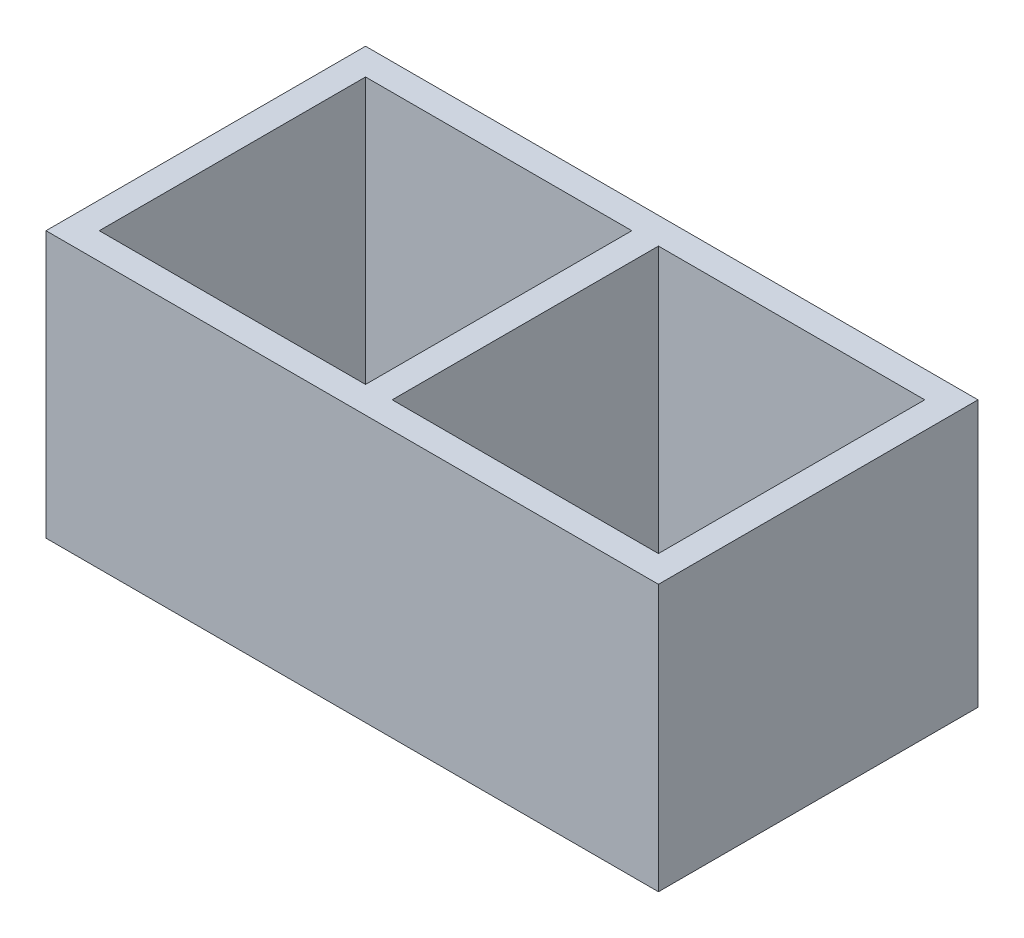
ISO-10303-21;
HEADER;
FILE_DESCRIPTION(('STEP AP214'),'2;1');
FILE_NAME('part.step','',(''),(''),'','','');
FILE_SCHEMA(('AUTOMOTIVE_DESIGN { 1 0 10303 214 1 1 1 1 }'));
ENDSEC;
DATA;
#1=APPLICATION_CONTEXT('core data for automotive mechanical design processes');
#2=APPLICATION_PROTOCOL_DEFINITION('international standard','automotive_design',2000,#1);
#3=PRODUCT_CONTEXT('',#1,'mechanical');
#4=PRODUCT('Part','Part','',(#3));
#5=PRODUCT_RELATED_PRODUCT_CATEGORY('part','',(#4));
#6=PRODUCT_DEFINITION_FORMATION('','',#4);
#7=PRODUCT_DEFINITION_CONTEXT('part definition',#1,'design');
#8=PRODUCT_DEFINITION('design','',#6,#7);
#9=PRODUCT_DEFINITION_SHAPE('','',#8);
#10=(LENGTH_UNIT() NAMED_UNIT(*) SI_UNIT(.MILLI.,.METRE.));
#11=(NAMED_UNIT(*) PLANE_ANGLE_UNIT() SI_UNIT($,.RADIAN.));
#12=(NAMED_UNIT(*) SI_UNIT($,.STERADIAN.) SOLID_ANGLE_UNIT());
#13=UNCERTAINTY_MEASURE_WITH_UNIT(LENGTH_MEASURE(1.E-05),#10,'distance_accuracy_value','');
#14=(GEOMETRIC_REPRESENTATION_CONTEXT(3) GLOBAL_UNCERTAINTY_ASSIGNED_CONTEXT((#13)) GLOBAL_UNIT_ASSIGNED_CONTEXT((#10,
#11,#12)) REPRESENTATION_CONTEXT('',''));
#15=CARTESIAN_POINT('',(0.,0.,0.));
#16=DIRECTION('',(0.,0.,1.));
#17=DIRECTION('',(1.,0.,0.));
#18=AXIS2_PLACEMENT_3D('',#15,#16,#17);
#19=CARTESIAN_POINT('',(0.,15.,0.));
#20=DIRECTION('',(0.,1.,0.));
#21=DIRECTION('',(0.,0.,1.));
#22=AXIS2_PLACEMENT_3D('',#19,#20,#21);
#23=PLANE('',#22);
#24=DIRECTION('',(-1.,0.,0.));
#25=VECTOR('',#24,1.);
#26=CARTESIAN_POINT('',(-15.75,15.,-7.5));
#27=LINE('',#26,#25);
#28=CARTESIAN_POINT('',(-0.749999999999969,15.,-7.5));
#29=VERTEX_POINT('',#28);
#30=CARTESIAN_POINT('',(-15.75,15.,-7.5));
#31=VERTEX_POINT('',#30);
#32=EDGE_CURVE('E160',#29,#31,#27,.T.);
#33=ORIENTED_EDGE('',*,*,#32,.F.);
#34=DIRECTION('',(0.,0.,-1.));
#35=VECTOR('',#34,1.);
#36=CARTESIAN_POINT('',(-0.749999999999969,15.,7.5));
#37=LINE('',#36,#35);
#38=CARTESIAN_POINT('',(-0.749999999999969,15.,7.5));
#39=VERTEX_POINT('',#38);
#40=EDGE_CURVE('E158',#39,#29,#37,.T.);
#41=ORIENTED_EDGE('',*,*,#40,.F.);
#42=DIRECTION('',(1.,0.,0.));
#43=VECTOR('',#42,1.);
#44=CARTESIAN_POINT('',(-15.75,15.,7.5));
#45=LINE('',#44,#43);
#46=CARTESIAN_POINT('',(-15.75,15.,7.5));
#47=VERTEX_POINT('',#46);
#48=EDGE_CURVE('E166',#47,#39,#45,.T.);
#49=ORIENTED_EDGE('',*,*,#48,.F.);
#50=DIRECTION('',(0.,0.,1.));
#51=VECTOR('',#50,1.);
#52=CARTESIAN_POINT('',(-15.75,15.,7.5));
#53=LINE('',#52,#51);
#54=EDGE_CURVE('E163',#31,#47,#53,.T.);
#55=ORIENTED_EDGE('',*,*,#54,.F.);
#56=EDGE_LOOP('',(#33,#41,#49,#55));
#57=FACE_BOUND('',#56,.T.);
#58=DIRECTION('',(0.,0.,1.));
#59=VECTOR('',#58,1.);
#60=CARTESIAN_POINT('',(-17.25,15.,9.));
#61=LINE('',#60,#59);
#62=CARTESIAN_POINT('',(-17.25,15.,-9.));
#63=VERTEX_POINT('',#62);
#64=CARTESIAN_POINT('',(-17.25,15.,9.));
#65=VERTEX_POINT('',#64);
#66=EDGE_CURVE('E189',#63,#65,#61,.T.);
#67=ORIENTED_EDGE('',*,*,#66,.T.);
#68=DIRECTION('',(1.,0.,0.));
#69=VECTOR('',#68,1.);
#70=CARTESIAN_POINT('',(17.25,15.,9.));
#71=LINE('',#70,#69);
#72=CARTESIAN_POINT('',(17.25,15.,9.));
#73=VERTEX_POINT('',#72);
#74=EDGE_CURVE('E192',#65,#73,#71,.T.);
#75=ORIENTED_EDGE('',*,*,#74,.T.);
#76=DIRECTION('',(0.,0.,-1.));
#77=VECTOR('',#76,1.);
#78=CARTESIAN_POINT('',(17.25,15.,9.));
#79=LINE('',#78,#77);
#80=CARTESIAN_POINT('',(17.25,15.,-9.00000000000001));
#81=VERTEX_POINT('',#80);
#82=EDGE_CURVE('E195',#73,#81,#79,.T.);
#83=ORIENTED_EDGE('',*,*,#82,.T.);
#84=DIRECTION('',(-1.,0.,0.));
#85=VECTOR('',#84,1.);
#86=CARTESIAN_POINT('',(17.25,15.,-9.00000000000001));
#87=LINE('',#86,#85);
#88=EDGE_CURVE('E197',#81,#63,#87,.T.);
#89=ORIENTED_EDGE('',*,*,#88,.T.);
#90=EDGE_LOOP('',(#67,#75,#83,#89));
#91=FACE_BOUND('',#90,.T.);
#92=DIRECTION('',(1.,0.,0.));
#93=VECTOR('',#92,1.);
#94=CARTESIAN_POINT('',(15.75,15.,7.5));
#95=LINE('',#94,#93);
#96=CARTESIAN_POINT('',(0.750000000000031,15.,7.5));
#97=VERTEX_POINT('',#96);
#98=CARTESIAN_POINT('',(15.75,15.,7.5));
#99=VERTEX_POINT('',#98);
#100=EDGE_CURVE('E130',#97,#99,#95,.T.);
#101=ORIENTED_EDGE('',*,*,#100,.F.);
#102=DIRECTION('',(0.,0.,1.));
#103=VECTOR('',#102,1.);
#104=CARTESIAN_POINT('',(0.750000000000031,15.,7.5));
#105=LINE('',#104,#103);
#106=CARTESIAN_POINT('',(0.750000000000031,15.,-7.5));
#107=VERTEX_POINT('',#106);
#108=EDGE_CURVE('E122',#107,#97,#105,.T.);
#109=ORIENTED_EDGE('',*,*,#108,.F.);
#110=DIRECTION('',(-1.,0.,0.));
#111=VECTOR('',#110,1.);
#112=CARTESIAN_POINT('',(15.75,15.,-7.5));
#113=LINE('',#112,#111);
#114=CARTESIAN_POINT('',(15.75,15.,-7.5));
#115=VERTEX_POINT('',#114);
#116=EDGE_CURVE('E144',#115,#107,#113,.T.);
#117=ORIENTED_EDGE('',*,*,#116,.F.);
#118=DIRECTION('',(0.,0.,-1.));
#119=VECTOR('',#118,1.);
#120=CARTESIAN_POINT('',(15.75,15.,7.5));
#121=LINE('',#120,#119);
#122=EDGE_CURVE('E142',#99,#115,#121,.T.);
#123=ORIENTED_EDGE('',*,*,#122,.F.);
#124=EDGE_LOOP('',(#101,#109,#117,#123));
#125=FACE_BOUND('',#124,.T.);
#126=ADVANCED_FACE('F33',(#57,#91,#125),#23,.T.);
#127=CARTESIAN_POINT('',(0.,0.,0.));
#128=DIRECTION('',(0.,1.,0.));
#129=DIRECTION('',(0.,0.,1.));
#130=AXIS2_PLACEMENT_3D('',#127,#128,#129);
#131=PLANE('',#130);
#132=DIRECTION('',(0.,0.,-1.));
#133=VECTOR('',#132,1.);
#134=CARTESIAN_POINT('',(-0.749999999999969,0.,7.5));
#135=LINE('',#134,#133);
#136=CARTESIAN_POINT('',(-0.749999999999969,0.,7.5));
#137=VERTEX_POINT('',#136);
#138=CARTESIAN_POINT('',(-0.749999999999969,0.,-7.5));
#139=VERTEX_POINT('',#138);
#140=EDGE_CURVE('E138',#137,#139,#135,.T.);
#141=ORIENTED_EDGE('',*,*,#140,.T.);
#142=DIRECTION('',(-1.,0.,0.));
#143=VECTOR('',#142,1.);
#144=CARTESIAN_POINT('',(-15.75,0.,-7.5));
#145=LINE('',#144,#143);
#146=CARTESIAN_POINT('',(-15.75,0.,-7.5));
#147=VERTEX_POINT('',#146);
#148=EDGE_CURVE('E171',#139,#147,#145,.T.);
#149=ORIENTED_EDGE('',*,*,#148,.T.);
#150=DIRECTION('',(0.,0.,1.));
#151=VECTOR('',#150,1.);
#152=CARTESIAN_POINT('',(-15.75,0.,7.5));
#153=LINE('',#152,#151);
#154=CARTESIAN_POINT('',(-15.75,0.,7.5));
#155=VERTEX_POINT('',#154);
#156=EDGE_CURVE('E174',#147,#155,#153,.T.);
#157=ORIENTED_EDGE('',*,*,#156,.T.);
#158=DIRECTION('',(1.,0.,0.));
#159=VECTOR('',#158,1.);
#160=CARTESIAN_POINT('',(-15.75,0.,7.5));
#161=LINE('',#160,#159);
#162=EDGE_CURVE('E161',#155,#137,#161,.T.);
#163=ORIENTED_EDGE('',*,*,#162,.T.);
#164=EDGE_LOOP('',(#141,#149,#157,#163));
#165=FACE_BOUND('',#164,.T.);
#166=DIRECTION('',(0.,0.,1.));
#167=VECTOR('',#166,1.);
#168=CARTESIAN_POINT('',(-17.25,0.,9.));
#169=LINE('',#168,#167);
#170=CARTESIAN_POINT('',(-17.25,0.,-9.));
#171=VERTEX_POINT('',#170);
#172=CARTESIAN_POINT('',(-17.25,0.,9.));
#173=VERTEX_POINT('',#172);
#174=EDGE_CURVE('E188',#171,#173,#169,.T.);
#175=ORIENTED_EDGE('',*,*,#174,.F.);
#176=DIRECTION('',(-1.,0.,0.));
#177=VECTOR('',#176,1.);
#178=CARTESIAN_POINT('',(17.25,0.,-9.00000000000001));
#179=LINE('',#178,#177);
#180=CARTESIAN_POINT('',(17.25,0.,-9.00000000000001));
#181=VERTEX_POINT('',#180);
#182=EDGE_CURVE('E193',#181,#171,#179,.T.);
#183=ORIENTED_EDGE('',*,*,#182,.F.);
#184=DIRECTION('',(0.,0.,-1.));
#185=VECTOR('',#184,1.);
#186=CARTESIAN_POINT('',(17.25,0.,9.));
#187=LINE('',#186,#185);
#188=CARTESIAN_POINT('',(17.25,0.,9.));
#189=VERTEX_POINT('',#188);
#190=EDGE_CURVE('E204',#189,#181,#187,.T.);
#191=ORIENTED_EDGE('',*,*,#190,.F.);
#192=DIRECTION('',(1.,0.,0.));
#193=VECTOR('',#192,1.);
#194=CARTESIAN_POINT('',(17.25,0.,9.));
#195=LINE('',#194,#193);
#196=EDGE_CURVE('E202',#173,#189,#195,.T.);
#197=ORIENTED_EDGE('',*,*,#196,.F.);
#198=EDGE_LOOP('',(#175,#183,#191,#197));
#199=FACE_BOUND('',#198,.T.);
#200=DIRECTION('',(0.,0.,1.));
#201=VECTOR('',#200,1.);
#202=CARTESIAN_POINT('',(0.750000000000031,0.,7.5));
#203=LINE('',#202,#201);
#204=CARTESIAN_POINT('',(0.750000000000031,0.,-7.5));
#205=VERTEX_POINT('',#204);
#206=CARTESIAN_POINT('',(0.750000000000031,0.,7.5));
#207=VERTEX_POINT('',#206);
#208=EDGE_CURVE('E56',#205,#207,#203,.T.);
#209=ORIENTED_EDGE('',*,*,#208,.T.);
#210=DIRECTION('',(1.,0.,0.));
#211=VECTOR('',#210,1.);
#212=CARTESIAN_POINT('',(15.75,0.,7.5));
#213=LINE('',#212,#211);
#214=CARTESIAN_POINT('',(15.75,0.,7.5));
#215=VERTEX_POINT('',#214);
#216=EDGE_CURVE('E137',#207,#215,#213,.T.);
#217=ORIENTED_EDGE('',*,*,#216,.T.);
#218=DIRECTION('',(0.,0.,-1.));
#219=VECTOR('',#218,1.);
#220=CARTESIAN_POINT('',(15.75,0.,7.5));
#221=LINE('',#220,#219);
#222=CARTESIAN_POINT('',(15.75,0.,-7.5));
#223=VERTEX_POINT('',#222);
#224=EDGE_CURVE('E150',#215,#223,#221,.T.);
#225=ORIENTED_EDGE('',*,*,#224,.T.);
#226=DIRECTION('',(-1.,0.,0.));
#227=VECTOR('',#226,1.);
#228=CARTESIAN_POINT('',(15.75,0.,-7.5));
#229=LINE('',#228,#227);
#230=EDGE_CURVE('E131',#223,#205,#229,.T.);
#231=ORIENTED_EDGE('',*,*,#230,.T.);
#232=EDGE_LOOP('',(#209,#217,#225,#231));
#233=FACE_BOUND('',#232,.T.);
#234=ADVANCED_FACE('F222',(#165,#199,#233),#131,.F.);
#235=CARTESIAN_POINT('',(-17.25,15.,9.));
#236=DIRECTION('',(1.,0.,0.));
#237=DIRECTION('',(0.,0.,-1.));
#238=AXIS2_PLACEMENT_3D('',#235,#236,#237);
#239=PLANE('',#238);
#240=ORIENTED_EDGE('',*,*,#174,.T.);
#241=DIRECTION('',(0.,-1.,0.));
#242=VECTOR('',#241,1.);
#243=CARTESIAN_POINT('',(-17.25,15.,9.));
#244=LINE('',#243,#242);
#245=EDGE_CURVE('E11',#65,#173,#244,.T.);
#246=ORIENTED_EDGE('',*,*,#245,.F.);
#247=ORIENTED_EDGE('',*,*,#66,.F.);
#248=DIRECTION('',(0.,-1.,0.));
#249=VECTOR('',#248,1.);
#250=CARTESIAN_POINT('',(-17.25,15.,-9.));
#251=LINE('',#250,#249);
#252=EDGE_CURVE('E199',#63,#171,#251,.T.);
#253=ORIENTED_EDGE('',*,*,#252,.T.);
#254=EDGE_LOOP('',(#240,#246,#247,#253));
#255=FACE_BOUND('',#254,.T.);
#256=ADVANCED_FACE('F35',(#255),#239,.F.);
#257=CARTESIAN_POINT('',(17.25,15.,9.));
#258=DIRECTION('',(0.,0.,-1.));
#259=DIRECTION('',(-1.,0.,0.));
#260=AXIS2_PLACEMENT_3D('',#257,#258,#259);
#261=PLANE('',#260);
#262=ORIENTED_EDGE('',*,*,#196,.T.);
#263=DIRECTION('',(0.,-1.,0.));
#264=VECTOR('',#263,1.);
#265=CARTESIAN_POINT('',(17.25,15.,9.));
#266=LINE('',#265,#264);
#267=EDGE_CURVE('E41',#73,#189,#266,.T.);
#268=ORIENTED_EDGE('',*,*,#267,.F.);
#269=ORIENTED_EDGE('',*,*,#74,.F.);
#270=ORIENTED_EDGE('',*,*,#245,.T.);
#271=EDGE_LOOP('',(#262,#268,#269,#270));
#272=FACE_BOUND('',#271,.T.);
#273=ADVANCED_FACE('F232',(#272),#261,.F.);
#274=CARTESIAN_POINT('',(17.25,15.,9.));
#275=DIRECTION('',(-1.,0.,0.));
#276=DIRECTION('',(0.,0.,1.));
#277=AXIS2_PLACEMENT_3D('',#274,#275,#276);
#278=PLANE('',#277);
#279=ORIENTED_EDGE('',*,*,#190,.T.);
#280=DIRECTION('',(0.,-1.,0.));
#281=VECTOR('',#280,1.);
#282=CARTESIAN_POINT('',(17.25,15.,-9.00000000000001));
#283=LINE('',#282,#281);
#284=EDGE_CURVE('E209',#81,#181,#283,.T.);
#285=ORIENTED_EDGE('',*,*,#284,.F.);
#286=ORIENTED_EDGE('',*,*,#82,.F.);
#287=ORIENTED_EDGE('',*,*,#267,.T.);
#288=EDGE_LOOP('',(#279,#285,#286,#287));
#289=FACE_BOUND('',#288,.T.);
#290=ADVANCED_FACE('F216',(#289),#278,.F.);
#291=CARTESIAN_POINT('',(17.25,15.,-9.00000000000001));
#292=DIRECTION('',(0.,0.,1.));
#293=DIRECTION('',(1.,0.,0.));
#294=AXIS2_PLACEMENT_3D('',#291,#292,#293);
#295=PLANE('',#294);
#296=ORIENTED_EDGE('',*,*,#182,.T.);
#297=ORIENTED_EDGE('',*,*,#252,.F.);
#298=ORIENTED_EDGE('',*,*,#88,.F.);
#299=ORIENTED_EDGE('',*,*,#284,.T.);
#300=EDGE_LOOP('',(#296,#297,#298,#299));
#301=FACE_BOUND('',#300,.T.);
#302=ADVANCED_FACE('F226',(#301),#295,.F.);
#303=CARTESIAN_POINT('',(-0.749999999999969,15.,7.5));
#304=DIRECTION('',(-1.,0.,0.));
#305=DIRECTION('',(0.,0.,1.));
#306=AXIS2_PLACEMENT_3D('',#303,#304,#305);
#307=PLANE('',#306);
#308=ORIENTED_EDGE('',*,*,#140,.F.);
#309=DIRECTION('',(0.,-1.,0.));
#310=VECTOR('',#309,1.);
#311=CARTESIAN_POINT('',(-0.749999999999969,15.,7.5));
#312=LINE('',#311,#310);
#313=EDGE_CURVE('E168',#39,#137,#312,.T.);
#314=ORIENTED_EDGE('',*,*,#313,.F.);
#315=ORIENTED_EDGE('',*,*,#40,.T.);
#316=DIRECTION('',(0.,-1.,0.));
#317=VECTOR('',#316,1.);
#318=CARTESIAN_POINT('',(-0.749999999999969,15.,-7.5));
#319=LINE('',#318,#317);
#320=EDGE_CURVE('E185',#29,#139,#319,.T.);
#321=ORIENTED_EDGE('',*,*,#320,.T.);
#322=EDGE_LOOP('',(#308,#314,#315,#321));
#323=FACE_BOUND('',#322,.T.);
#324=ADVANCED_FACE('F249',(#323),#307,.T.);
#325=CARTESIAN_POINT('',(-15.75,15.,-7.5));
#326=DIRECTION('',(0.,0.,1.));
#327=DIRECTION('',(1.,0.,0.));
#328=AXIS2_PLACEMENT_3D('',#325,#326,#327);
#329=PLANE('',#328);
#330=ORIENTED_EDGE('',*,*,#148,.F.);
#331=ORIENTED_EDGE('',*,*,#320,.F.);
#332=ORIENTED_EDGE('',*,*,#32,.T.);
#333=DIRECTION('',(0.,-1.,0.));
#334=VECTOR('',#333,1.);
#335=CARTESIAN_POINT('',(-15.75,15.,-7.5));
#336=LINE('',#335,#334);
#337=EDGE_CURVE('E183',#31,#147,#336,.T.);
#338=ORIENTED_EDGE('',*,*,#337,.T.);
#339=EDGE_LOOP('',(#330,#331,#332,#338));
#340=FACE_BOUND('',#339,.T.);
#341=ADVANCED_FACE('F256',(#340),#329,.T.);
#342=CARTESIAN_POINT('',(-15.75,15.,7.5));
#343=DIRECTION('',(1.,0.,0.));
#344=DIRECTION('',(0.,0.,-1.));
#345=AXIS2_PLACEMENT_3D('',#342,#343,#344);
#346=PLANE('',#345);
#347=ORIENTED_EDGE('',*,*,#156,.F.);
#348=ORIENTED_EDGE('',*,*,#337,.F.);
#349=ORIENTED_EDGE('',*,*,#54,.T.);
#350=DIRECTION('',(0.,-1.,0.));
#351=VECTOR('',#350,1.);
#352=CARTESIAN_POINT('',(-15.75,15.,7.5));
#353=LINE('',#352,#351);
#354=EDGE_CURVE('E181',#47,#155,#353,.T.);
#355=ORIENTED_EDGE('',*,*,#354,.T.);
#356=EDGE_LOOP('',(#347,#348,#349,#355));
#357=FACE_BOUND('',#356,.T.);
#358=ADVANCED_FACE('F261',(#357),#346,.T.);
#359=CARTESIAN_POINT('',(-15.75,15.,7.5));
#360=DIRECTION('',(0.,0.,-1.));
#361=DIRECTION('',(-1.,0.,0.));
#362=AXIS2_PLACEMENT_3D('',#359,#360,#361);
#363=PLANE('',#362);
#364=ORIENTED_EDGE('',*,*,#162,.F.);
#365=ORIENTED_EDGE('',*,*,#354,.F.);
#366=ORIENTED_EDGE('',*,*,#48,.T.);
#367=ORIENTED_EDGE('',*,*,#313,.T.);
#368=EDGE_LOOP('',(#364,#365,#366,#367));
#369=FACE_BOUND('',#368,.T.);
#370=ADVANCED_FACE('F268',(#369),#363,.T.);
#371=CARTESIAN_POINT('',(0.750000000000031,15.,7.5));
#372=DIRECTION('',(1.,0.,0.));
#373=DIRECTION('',(0.,0.,-1.));
#374=AXIS2_PLACEMENT_3D('',#371,#372,#373);
#375=PLANE('',#374);
#376=ORIENTED_EDGE('',*,*,#208,.F.);
#377=DIRECTION('',(0.,-1.,0.));
#378=VECTOR('',#377,1.);
#379=CARTESIAN_POINT('',(0.750000000000031,15.,-7.5));
#380=LINE('',#379,#378);
#381=EDGE_CURVE('E126',#107,#205,#380,.T.);
#382=ORIENTED_EDGE('',*,*,#381,.F.);
#383=ORIENTED_EDGE('',*,*,#108,.T.);
#384=DIRECTION('',(0.,-1.,0.));
#385=VECTOR('',#384,1.);
#386=CARTESIAN_POINT('',(0.750000000000031,15.,7.5));
#387=LINE('',#386,#385);
#388=EDGE_CURVE('E125',#97,#207,#387,.T.);
#389=ORIENTED_EDGE('',*,*,#388,.T.);
#390=EDGE_LOOP('',(#376,#382,#383,#389));
#391=FACE_BOUND('',#390,.T.);
#392=ADVANCED_FACE('F124',(#391),#375,.T.);
#393=CARTESIAN_POINT('',(15.75,15.,7.5));
#394=DIRECTION('',(0.,0.,-1.));
#395=DIRECTION('',(-1.,0.,0.));
#396=AXIS2_PLACEMENT_3D('',#393,#394,#395);
#397=PLANE('',#396);
#398=ORIENTED_EDGE('',*,*,#216,.F.);
#399=ORIENTED_EDGE('',*,*,#388,.F.);
#400=ORIENTED_EDGE('',*,*,#100,.T.);
#401=DIRECTION('',(0.,-1.,0.));
#402=VECTOR('',#401,1.);
#403=CARTESIAN_POINT('',(15.75,15.,7.5));
#404=LINE('',#403,#402);
#405=EDGE_CURVE('E139',#99,#215,#404,.T.);
#406=ORIENTED_EDGE('',*,*,#405,.T.);
#407=EDGE_LOOP('',(#398,#399,#400,#406));
#408=FACE_BOUND('',#407,.T.);
#409=ADVANCED_FACE('F134',(#408),#397,.T.);
#410=CARTESIAN_POINT('',(15.75,15.,7.5));
#411=DIRECTION('',(-1.,0.,0.));
#412=DIRECTION('',(0.,0.,1.));
#413=AXIS2_PLACEMENT_3D('',#410,#411,#412);
#414=PLANE('',#413);
#415=ORIENTED_EDGE('',*,*,#224,.F.);
#416=ORIENTED_EDGE('',*,*,#405,.F.);
#417=ORIENTED_EDGE('',*,*,#122,.T.);
#418=DIRECTION('',(0.,-1.,0.));
#419=VECTOR('',#418,1.);
#420=CARTESIAN_POINT('',(15.75,15.,-7.5));
#421=LINE('',#420,#419);
#422=EDGE_CURVE('E48',#115,#223,#421,.T.);
#423=ORIENTED_EDGE('',*,*,#422,.T.);
#424=EDGE_LOOP('',(#415,#416,#417,#423));
#425=FACE_BOUND('',#424,.T.);
#426=ADVANCED_FACE('F285',(#425),#414,.T.);
#427=CARTESIAN_POINT('',(15.75,15.,-7.5));
#428=DIRECTION('',(0.,0.,1.));
#429=DIRECTION('',(1.,0.,0.));
#430=AXIS2_PLACEMENT_3D('',#427,#428,#429);
#431=PLANE('',#430);
#432=ORIENTED_EDGE('',*,*,#230,.F.);
#433=ORIENTED_EDGE('',*,*,#422,.F.);
#434=ORIENTED_EDGE('',*,*,#116,.T.);
#435=ORIENTED_EDGE('',*,*,#381,.T.);
#436=EDGE_LOOP('',(#432,#433,#434,#435));
#437=FACE_BOUND('',#436,.T.);
#438=ADVANCED_FACE('F288',(#437),#431,.T.);
#439=CLOSED_SHELL('',(#126,#234,#256,#273,#290,#302,#324,#341,#358,#370,#392,#409,#426,#438));
#440=MANIFOLD_SOLID_BREP('B2',#439);
#441=ADVANCED_BREP_SHAPE_REPRESENTATION('',(#18,#440),#14);
#442=SHAPE_DEFINITION_REPRESENTATION(#9,#441);
ENDSEC;
END-ISO-10303-21;
